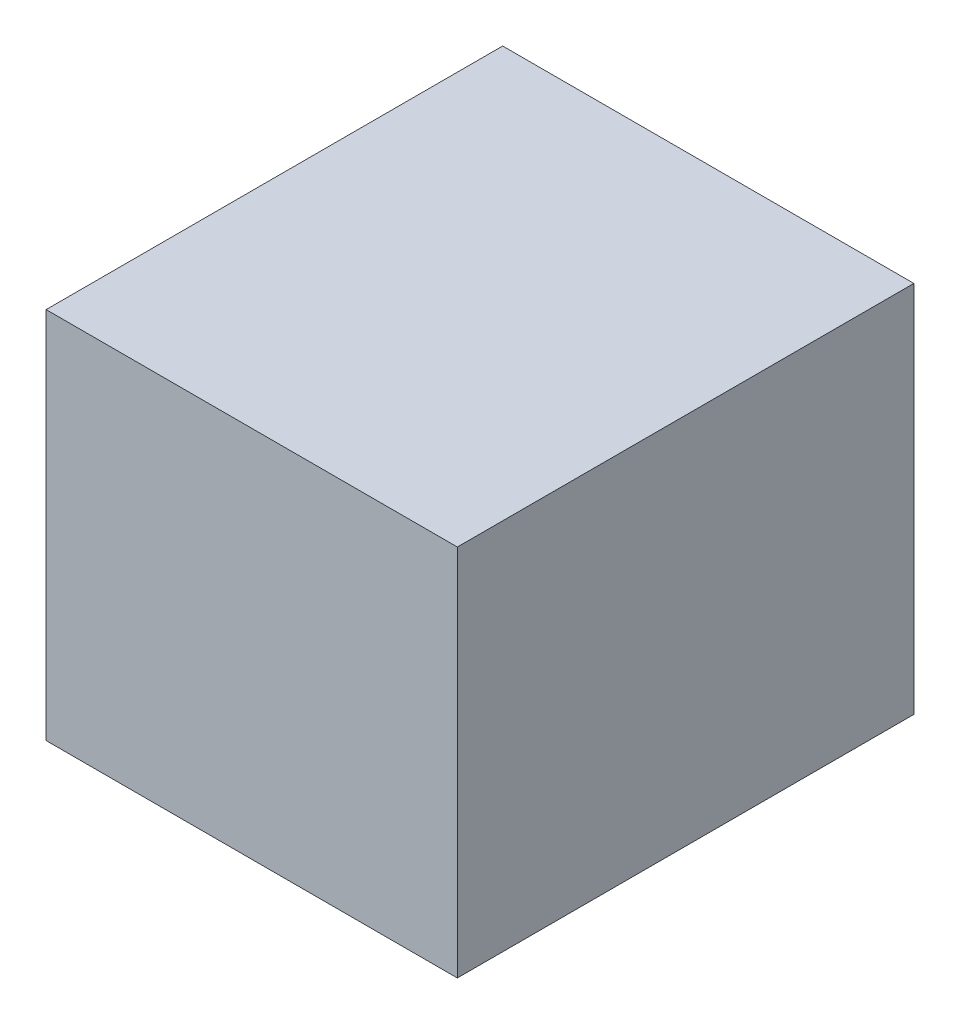
ISO-10303-21;
HEADER;
FILE_DESCRIPTION(('STEP AP214'),'2;1');
FILE_NAME('part.step','',(''),(''),'','','');
FILE_SCHEMA(('AUTOMOTIVE_DESIGN { 1 0 10303 214 1 1 1 1 }'));
ENDSEC;
DATA;
#1=APPLICATION_CONTEXT('core data for automotive mechanical design processes');
#2=APPLICATION_PROTOCOL_DEFINITION('international standard','automotive_design',2000,#1);
#3=PRODUCT_CONTEXT('',#1,'mechanical');
#4=PRODUCT('Part','Part','',(#3));
#5=PRODUCT_RELATED_PRODUCT_CATEGORY('part','',(#4));
#6=PRODUCT_DEFINITION_FORMATION('','',#4);
#7=PRODUCT_DEFINITION_CONTEXT('part definition',#1,'design');
#8=PRODUCT_DEFINITION('design','',#6,#7);
#9=PRODUCT_DEFINITION_SHAPE('','',#8);
#10=(LENGTH_UNIT() NAMED_UNIT(*) SI_UNIT(.MILLI.,.METRE.));
#11=(NAMED_UNIT(*) PLANE_ANGLE_UNIT() SI_UNIT($,.RADIAN.));
#12=(NAMED_UNIT(*) SI_UNIT($,.STERADIAN.) SOLID_ANGLE_UNIT());
#13=UNCERTAINTY_MEASURE_WITH_UNIT(LENGTH_MEASURE(1.E-05),#10,'distance_accuracy_value','');
#14=(GEOMETRIC_REPRESENTATION_CONTEXT(3) GLOBAL_UNCERTAINTY_ASSIGNED_CONTEXT((#13)) GLOBAL_UNIT_ASSIGNED_CONTEXT((#10,
#11,#12)) REPRESENTATION_CONTEXT('',''));
#15=CARTESIAN_POINT('',(0.,0.,0.));
#16=DIRECTION('',(0.,0.,1.));
#17=DIRECTION('',(1.,0.,0.));
#18=AXIS2_PLACEMENT_3D('',#15,#16,#17);
#19=CARTESIAN_POINT('',(49.53,44.958,-54.991));
#20=DIRECTION('',(1.,0.,0.));
#21=DIRECTION('',(0.,1.,0.));
#22=AXIS2_PLACEMENT_3D('',#19,#20,#21);
#23=PLANE('',#22);
#24=DIRECTION('',(0.,0.,1.));
#25=VECTOR('',#24,1.);
#26=CARTESIAN_POINT('',(49.53,44.958,-54.991));
#27=LINE('',#26,#25);
#28=CARTESIAN_POINT('',(49.53,44.958,-54.991));
#29=VERTEX_POINT('',#28);
#30=CARTESIAN_POINT('',(49.53,44.958,54.991));
#31=VERTEX_POINT('',#30);
#32=EDGE_CURVE('E35',#29,#31,#27,.T.);
#33=ORIENTED_EDGE('',*,*,#32,.T.);
#34=DIRECTION('',(0.,1.,0.));
#35=VECTOR('',#34,1.);
#36=CARTESIAN_POINT('',(49.53,44.958,54.991));
#37=LINE('',#36,#35);
#38=CARTESIAN_POINT('',(49.53,-44.958,54.991));
#39=VERTEX_POINT('',#38);
#40=EDGE_CURVE('E72',#39,#31,#37,.T.);
#41=ORIENTED_EDGE('',*,*,#40,.F.);
#42=DIRECTION('',(0.,0.,1.));
#43=VECTOR('',#42,1.);
#44=CARTESIAN_POINT('',(49.53,-44.958,-54.991));
#45=LINE('',#44,#43);
#46=CARTESIAN_POINT('',(49.53,-44.958,-54.991));
#47=VERTEX_POINT('',#46);
#48=EDGE_CURVE('E11',#47,#39,#45,.T.);
#49=ORIENTED_EDGE('',*,*,#48,.F.);
#50=DIRECTION('',(0.,1.,0.));
#51=VECTOR('',#50,1.);
#52=CARTESIAN_POINT('',(49.53,44.958,-54.991));
#53=LINE('',#52,#51);
#54=EDGE_CURVE('E73',#47,#29,#53,.T.);
#55=ORIENTED_EDGE('',*,*,#54,.T.);
#56=EDGE_LOOP('',(#33,#41,#49,#55));
#57=FACE_BOUND('',#56,.T.);
#58=ADVANCED_FACE('F32',(#57),#23,.T.);
#59=CARTESIAN_POINT('',(-49.53,-44.958,-54.991));
#60=DIRECTION('',(0.,-1.,0.));
#61=DIRECTION('',(0.,0.,-1.));
#62=AXIS2_PLACEMENT_3D('',#59,#60,#61);
#63=PLANE('',#62);
#64=ORIENTED_EDGE('',*,*,#48,.T.);
#65=DIRECTION('',(1.,0.,0.));
#66=VECTOR('',#65,1.);
#67=CARTESIAN_POINT('',(-49.53,-44.958,54.991));
#68=LINE('',#67,#66);
#69=CARTESIAN_POINT('',(-49.53,-44.958,54.991));
#70=VERTEX_POINT('',#69);
#71=EDGE_CURVE('E89',#70,#39,#68,.T.);
#72=ORIENTED_EDGE('',*,*,#71,.F.);
#73=DIRECTION('',(0.,0.,1.));
#74=VECTOR('',#73,1.);
#75=CARTESIAN_POINT('',(-49.53,-44.958,-54.991));
#76=LINE('',#75,#74);
#77=CARTESIAN_POINT('',(-49.53,-44.958,-54.991));
#78=VERTEX_POINT('',#77);
#79=EDGE_CURVE('E40',#78,#70,#76,.T.);
#80=ORIENTED_EDGE('',*,*,#79,.F.);
#81=DIRECTION('',(1.,0.,0.));
#82=VECTOR('',#81,1.);
#83=CARTESIAN_POINT('',(-49.53,-44.958,-54.991));
#84=LINE('',#83,#82);
#85=EDGE_CURVE('E78',#78,#47,#84,.T.);
#86=ORIENTED_EDGE('',*,*,#85,.T.);
#87=EDGE_LOOP('',(#64,#72,#80,#86));
#88=FACE_BOUND('',#87,.T.);
#89=ADVANCED_FACE('F104',(#88),#63,.T.);
#90=CARTESIAN_POINT('',(-49.53,44.958,-54.991));
#91=DIRECTION('',(-1.,0.,0.));
#92=DIRECTION('',(0.,-1.,0.));
#93=AXIS2_PLACEMENT_3D('',#90,#91,#92);
#94=PLANE('',#93);
#95=ORIENTED_EDGE('',*,*,#79,.T.);
#96=DIRECTION('',(0.,-1.,0.));
#97=VECTOR('',#96,1.);
#98=CARTESIAN_POINT('',(-49.53,44.958,54.991));
#99=LINE('',#98,#97);
#100=CARTESIAN_POINT('',(-49.53,44.958,54.991));
#101=VERTEX_POINT('',#100);
#102=EDGE_CURVE('E85',#101,#70,#99,.T.);
#103=ORIENTED_EDGE('',*,*,#102,.F.);
#104=DIRECTION('',(0.,0.,1.));
#105=VECTOR('',#104,1.);
#106=CARTESIAN_POINT('',(-49.53,44.958,-54.991));
#107=LINE('',#106,#105);
#108=CARTESIAN_POINT('',(-49.53,44.958,-54.991));
#109=VERTEX_POINT('',#108);
#110=EDGE_CURVE('E77',#109,#101,#107,.T.);
#111=ORIENTED_EDGE('',*,*,#110,.F.);
#112=DIRECTION('',(0.,-1.,0.));
#113=VECTOR('',#112,1.);
#114=CARTESIAN_POINT('',(-49.53,44.958,-54.991));
#115=LINE('',#114,#113);
#116=EDGE_CURVE('E97',#109,#78,#115,.T.);
#117=ORIENTED_EDGE('',*,*,#116,.T.);
#118=EDGE_LOOP('',(#95,#103,#111,#117));
#119=FACE_BOUND('',#118,.T.);
#120=ADVANCED_FACE('F101',(#119),#94,.T.);
#121=CARTESIAN_POINT('',(-49.53,44.958,-54.991));
#122=DIRECTION('',(0.,1.,0.));
#123=DIRECTION('',(0.,0.,1.));
#124=AXIS2_PLACEMENT_3D('',#121,#122,#123);
#125=PLANE('',#124);
#126=ORIENTED_EDGE('',*,*,#110,.T.);
#127=DIRECTION('',(-1.,0.,0.));
#128=VECTOR('',#127,1.);
#129=CARTESIAN_POINT('',(-49.53,44.958,54.991));
#130=LINE('',#129,#128);
#131=EDGE_CURVE('E80',#31,#101,#130,.T.);
#132=ORIENTED_EDGE('',*,*,#131,.F.);
#133=ORIENTED_EDGE('',*,*,#32,.F.);
#134=DIRECTION('',(-1.,0.,0.));
#135=VECTOR('',#134,1.);
#136=CARTESIAN_POINT('',(-49.53,44.958,-54.991));
#137=LINE('',#136,#135);
#138=EDGE_CURVE('E95',#29,#109,#137,.T.);
#139=ORIENTED_EDGE('',*,*,#138,.T.);
#140=EDGE_LOOP('',(#126,#132,#133,#139));
#141=FACE_BOUND('',#140,.T.);
#142=ADVANCED_FACE('F81',(#141),#125,.T.);
#143=CARTESIAN_POINT('',(0.,0.,-54.991));
#144=DIRECTION('',(0.,0.,1.));
#145=DIRECTION('',(1.,0.,0.));
#146=AXIS2_PLACEMENT_3D('',#143,#144,#145);
#147=PLANE('',#146);
#148=ORIENTED_EDGE('',*,*,#54,.F.);
#149=ORIENTED_EDGE('',*,*,#85,.F.);
#150=ORIENTED_EDGE('',*,*,#116,.F.);
#151=ORIENTED_EDGE('',*,*,#138,.F.);
#152=EDGE_LOOP('',(#148,#149,#150,#151));
#153=FACE_BOUND('',#152,.T.);
#154=ADVANCED_FACE('F106',(#153),#147,.F.);
#155=CARTESIAN_POINT('',(0.,0.,54.991));
#156=DIRECTION('',(0.,0.,1.));
#157=DIRECTION('',(1.,0.,0.));
#158=AXIS2_PLACEMENT_3D('',#155,#156,#157);
#159=PLANE('',#158);
#160=ORIENTED_EDGE('',*,*,#40,.T.);
#161=ORIENTED_EDGE('',*,*,#131,.T.);
#162=ORIENTED_EDGE('',*,*,#102,.T.);
#163=ORIENTED_EDGE('',*,*,#71,.T.);
#164=EDGE_LOOP('',(#160,#161,#162,#163));
#165=FACE_BOUND('',#164,.T.);
#166=ADVANCED_FACE('F88',(#165),#159,.T.);
#167=CLOSED_SHELL('',(#58,#89,#120,#142,#154,#166));
#168=MANIFOLD_SOLID_BREP('B2',#167);
#169=ADVANCED_BREP_SHAPE_REPRESENTATION('',(#18,#168),#14);
#170=SHAPE_DEFINITION_REPRESENTATION(#9,#169);
ENDSEC;
END-ISO-10303-21;
